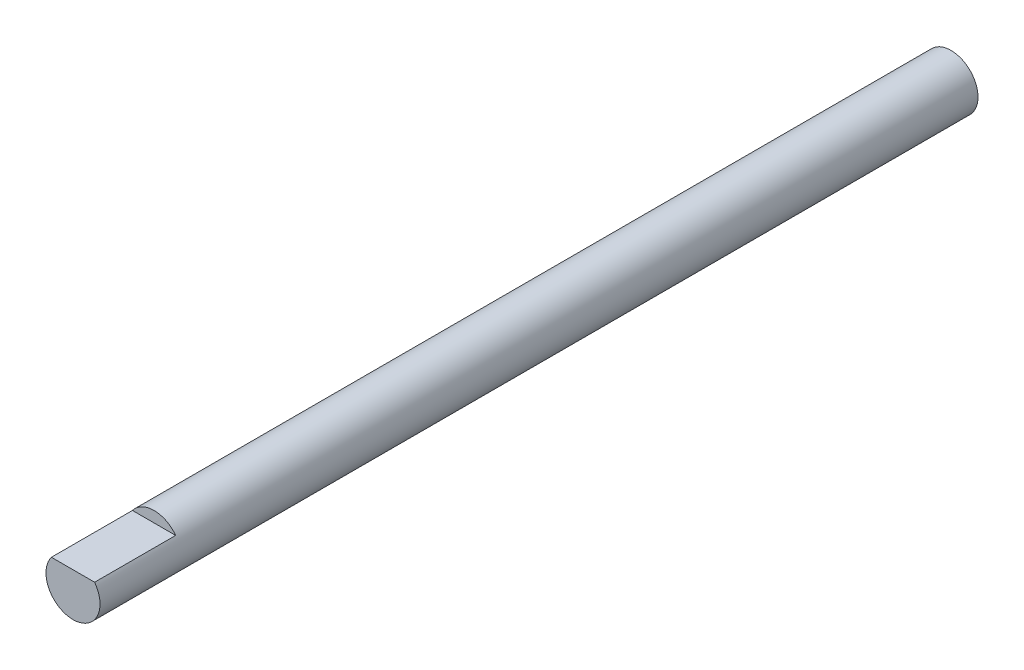
ISO-10303-21;
HEADER;
FILE_DESCRIPTION(('STEP AP214'),'2;1');
FILE_NAME('part.step','',(''),(''),'','','');
FILE_SCHEMA(('AUTOMOTIVE_DESIGN { 1 0 10303 214 1 1 1 1 }'));
ENDSEC;
DATA;
#1=APPLICATION_CONTEXT('core data for automotive mechanical design processes');
#2=APPLICATION_PROTOCOL_DEFINITION('international standard','automotive_design',2000,#1);
#3=PRODUCT_CONTEXT('',#1,'mechanical');
#4=PRODUCT('Part','Part','',(#3));
#5=PRODUCT_RELATED_PRODUCT_CATEGORY('part','',(#4));
#6=PRODUCT_DEFINITION_FORMATION('','',#4);
#7=PRODUCT_DEFINITION_CONTEXT('part definition',#1,'design');
#8=PRODUCT_DEFINITION('design','',#6,#7);
#9=PRODUCT_DEFINITION_SHAPE('','',#8);
#10=(LENGTH_UNIT() NAMED_UNIT(*) SI_UNIT(.MILLI.,.METRE.));
#11=(NAMED_UNIT(*) PLANE_ANGLE_UNIT() SI_UNIT($,.RADIAN.));
#12=(NAMED_UNIT(*) SI_UNIT($,.STERADIAN.) SOLID_ANGLE_UNIT());
#13=UNCERTAINTY_MEASURE_WITH_UNIT(LENGTH_MEASURE(1.E-05),#10,'distance_accuracy_value','');
#14=(GEOMETRIC_REPRESENTATION_CONTEXT(3) GLOBAL_UNCERTAINTY_ASSIGNED_CONTEXT((#13)) GLOBAL_UNIT_ASSIGNED_CONTEXT((#10,
#11,#12)) REPRESENTATION_CONTEXT('',''));
#15=CARTESIAN_POINT('',(0.,0.,0.));
#16=DIRECTION('',(0.,0.,1.));
#17=DIRECTION('',(1.,0.,0.));
#18=AXIS2_PLACEMENT_3D('',#15,#16,#17);
#19=CARTESIAN_POINT('',(0.,0.,130.));
#20=DIRECTION('',(0.,0.,-1.));
#21=DIRECTION('',(-1.,0.,0.));
#22=AXIS2_PLACEMENT_3D('',#19,#20,#21);
#23=CYLINDRICAL_SURFACE('',#22,4.);
#24=CARTESIAN_POINT('',(0.,0.,130.));
#25=DIRECTION('',(0.,0.,1.));
#26=DIRECTION('',(1.,0.,0.));
#27=AXIS2_PLACEMENT_3D('',#24,#25,#26);
#28=CIRCLE('',#27,4.);
#29=CARTESIAN_POINT('',(-3.2,2.4,130.));
#30=VERTEX_POINT('',#29);
#31=CARTESIAN_POINT('',(3.2,2.4,130.));
#32=VERTEX_POINT('',#31);
#33=EDGE_CURVE('E11',#30,#32,#28,.T.);
#34=ORIENTED_EDGE('',*,*,#33,.F.);
#35=DIRECTION('',(0.,0.,1.));
#36=VECTOR('',#35,1.);
#37=CARTESIAN_POINT('',(-3.2,2.4,118.));
#38=LINE('',#37,#36);
#39=CARTESIAN_POINT('',(-3.2,2.4,118.));
#40=VERTEX_POINT('',#39);
#41=EDGE_CURVE('E60',#40,#30,#38,.T.);
#42=ORIENTED_EDGE('',*,*,#41,.F.);
#43=CARTESIAN_POINT('',(0.,0.,118.));
#44=DIRECTION('',(0.,0.,-1.));
#45=DIRECTION('',(-1.,0.,0.));
#46=AXIS2_PLACEMENT_3D('',#43,#44,#45);
#47=CIRCLE('',#46,4.);
#48=CARTESIAN_POINT('',(3.2,2.4,118.));
#49=VERTEX_POINT('',#48);
#50=EDGE_CURVE('E68',#40,#49,#47,.T.);
#51=ORIENTED_EDGE('',*,*,#50,.T.);
#52=DIRECTION('',(0.,0.,1.));
#53=VECTOR('',#52,1.);
#54=CARTESIAN_POINT('',(3.2,2.4,118.));
#55=LINE('',#54,#53);
#56=EDGE_CURVE('E75',#49,#32,#55,.T.);
#57=ORIENTED_EDGE('',*,*,#56,.T.);
#58=EDGE_LOOP('',(#34,#42,#51,#57));
#59=FACE_BOUND('',#58,.T.);
#60=CARTESIAN_POINT('',(0.,0.,0.));
#61=DIRECTION('',(0.,0.,1.));
#62=DIRECTION('',(1.,0.,0.));
#63=AXIS2_PLACEMENT_3D('',#60,#61,#62);
#64=CIRCLE('',#63,4.);
#65=CARTESIAN_POINT('',(4.,0.,0.));
#66=VERTEX_POINT('',#65);
#67=EDGE_CURVE('E48',#66,#66,#64,.T.);
#68=ORIENTED_EDGE('',*,*,#67,.T.);
#69=EDGE_LOOP('',(#68));
#70=FACE_BOUND('',#69,.T.);
#71=ADVANCED_FACE('F45',(#59,#70),#23,.T.);
#72=CARTESIAN_POINT('',(0.,0.,130.));
#73=DIRECTION('',(0.,0.,1.));
#74=DIRECTION('',(1.,0.,0.));
#75=AXIS2_PLACEMENT_3D('',#72,#73,#74);
#76=PLANE('',#75);
#77=DIRECTION('',(1.,0.,0.));
#78=VECTOR('',#77,1.);
#79=CARTESIAN_POINT('',(-3.2,2.4,130.));
#80=LINE('',#79,#78);
#81=EDGE_CURVE('E72',#30,#32,#80,.T.);
#82=ORIENTED_EDGE('',*,*,#81,.F.);
#83=ORIENTED_EDGE('',*,*,#33,.T.);
#84=EDGE_LOOP('',(#82,#83));
#85=FACE_BOUND('',#84,.T.);
#86=ADVANCED_FACE('F84',(#85),#76,.T.);
#87=CARTESIAN_POINT('',(0.,0.,0.));
#88=DIRECTION('',(0.,0.,1.));
#89=DIRECTION('',(1.,0.,0.));
#90=AXIS2_PLACEMENT_3D('',#87,#88,#89);
#91=PLANE('',#90);
#92=ORIENTED_EDGE('',*,*,#67,.F.);
#93=EDGE_LOOP('',(#92));
#94=FACE_BOUND('',#93,.T.);
#95=ADVANCED_FACE('F86',(#94),#91,.F.);
#96=CARTESIAN_POINT('',(-3.2,2.4,118.));
#97=DIRECTION('',(0.,-1.,0.));
#98=DIRECTION('',(0.,0.,-1.));
#99=AXIS2_PLACEMENT_3D('',#96,#97,#98);
#100=PLANE('',#99);
#101=ORIENTED_EDGE('',*,*,#81,.T.);
#102=ORIENTED_EDGE('',*,*,#56,.F.);
#103=DIRECTION('',(1.,0.,0.));
#104=VECTOR('',#103,1.);
#105=CARTESIAN_POINT('',(-3.2,2.4,118.));
#106=LINE('',#105,#104);
#107=EDGE_CURVE('E141',#40,#49,#106,.T.);
#108=ORIENTED_EDGE('',*,*,#107,.F.);
#109=ORIENTED_EDGE('',*,*,#41,.T.);
#110=EDGE_LOOP('',(#101,#102,#108,#109));
#111=FACE_BOUND('',#110,.T.);
#112=ADVANCED_FACE('F74',(#111),#100,.F.);
#113=CARTESIAN_POINT('',(0.,0.,118.));
#114=DIRECTION('',(0.,0.,-1.));
#115=DIRECTION('',(-1.,0.,0.));
#116=AXIS2_PLACEMENT_3D('',#113,#114,#115);
#117=PLANE('',#116);
#118=ORIENTED_EDGE('',*,*,#50,.F.);
#119=ORIENTED_EDGE('',*,*,#107,.T.);
#120=EDGE_LOOP('',(#118,#119));
#121=FACE_BOUND('',#120,.T.);
#122=ADVANCED_FACE('F96',(#121),#117,.F.);
#123=CLOSED_SHELL('',(#71,#86,#95,#112,#122));
#124=MANIFOLD_SOLID_BREP('B2',#123);
#125=ADVANCED_BREP_SHAPE_REPRESENTATION('',(#18,#124),#14);
#126=SHAPE_DEFINITION_REPRESENTATION(#9,#125);
ENDSEC;
END-ISO-10303-21;
